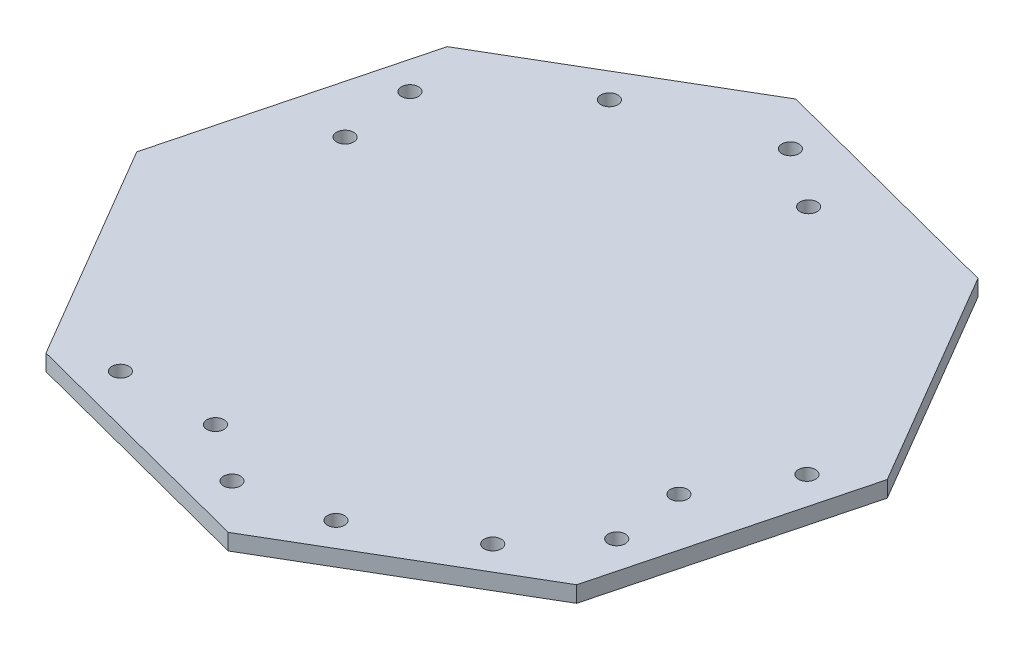
ISO-10303-21;
HEADER;
FILE_DESCRIPTION(('STEP AP214'),'2;1');
FILE_NAME('part.step','',(''),(''),'','','');
FILE_SCHEMA(('AUTOMOTIVE_DESIGN { 1 0 10303 214 1 1 1 1 }'));
ENDSEC;
DATA;
#1=APPLICATION_CONTEXT('core data for automotive mechanical design processes');
#2=APPLICATION_PROTOCOL_DEFINITION('international standard','automotive_design',2000,#1);
#3=PRODUCT_CONTEXT('',#1,'mechanical');
#4=PRODUCT('Part','Part','',(#3));
#5=PRODUCT_RELATED_PRODUCT_CATEGORY('part','',(#4));
#6=PRODUCT_DEFINITION_FORMATION('','',#4);
#7=PRODUCT_DEFINITION_CONTEXT('part definition',#1,'design');
#8=PRODUCT_DEFINITION('design','',#6,#7);
#9=PRODUCT_DEFINITION_SHAPE('','',#8);
#10=(LENGTH_UNIT() NAMED_UNIT(*) SI_UNIT(.MILLI.,.METRE.));
#11=(NAMED_UNIT(*) PLANE_ANGLE_UNIT() SI_UNIT($,.RADIAN.));
#12=(NAMED_UNIT(*) SI_UNIT($,.STERADIAN.) SOLID_ANGLE_UNIT());
#13=UNCERTAINTY_MEASURE_WITH_UNIT(LENGTH_MEASURE(1.E-05),#10,'distance_accuracy_value','');
#14=(GEOMETRIC_REPRESENTATION_CONTEXT(3) GLOBAL_UNCERTAINTY_ASSIGNED_CONTEXT((#13)) GLOBAL_UNIT_ASSIGNED_CONTEXT((#10,
#11,#12)) REPRESENTATION_CONTEXT('',''));
#15=CARTESIAN_POINT('',(0.,0.,0.));
#16=DIRECTION('',(0.,0.,1.));
#17=DIRECTION('',(1.,0.,0.));
#18=AXIS2_PLACEMENT_3D('',#15,#16,#17);
#19=CARTESIAN_POINT('',(-169.005629429316,-173.109741769084,-350.428110609482));
#20=DIRECTION('',(0.506112810529907,0.,0.862467288085477));
#21=DIRECTION('',(0.862467288085477,0.,-0.506112810529907));
#22=AXIS2_PLACEMENT_3D('',#19,#20,#21);
#23=PLANE('',#22);
#24=DIRECTION('',(0.862467288085477,0.,-0.506112810529907));
#25=VECTOR('',#24,1.);
#26=CARTESIAN_POINT('',(-169.005629429316,-170.109741769084,-350.428110609482));
#27=LINE('',#26,#25);
#28=CARTESIAN_POINT('',(-169.005629429316,-170.109741769084,-350.428110609482));
#29=VERTEX_POINT('',#28);
#30=CARTESIAN_POINT('',(-128.172451882559,-170.109741769084,-374.389824330743));
#31=VERTEX_POINT('',#30);
#32=EDGE_CURVE('E133',#29,#31,#27,.T.);
#33=ORIENTED_EDGE('',*,*,#32,.T.);
#34=DIRECTION('',(0.,1.,0.));
#35=VECTOR('',#34,1.);
#36=CARTESIAN_POINT('',(-128.172451882559,-173.109741769084,-374.389824330743));
#37=LINE('',#36,#35);
#38=CARTESIAN_POINT('',(-128.172451882559,-173.109741769084,-374.389824330743));
#39=VERTEX_POINT('',#38);
#40=EDGE_CURVE('E11',#39,#31,#37,.T.);
#41=ORIENTED_EDGE('',*,*,#40,.F.);
#42=DIRECTION('',(0.862467288085477,0.,-0.506112810529907));
#43=VECTOR('',#42,1.);
#44=CARTESIAN_POINT('',(-169.005629429316,-173.109741769084,-350.428110609482));
#45=LINE('',#44,#43);
#46=CARTESIAN_POINT('',(-169.005629429316,-173.109741769084,-350.428110609482));
#47=VERTEX_POINT('',#46);
#48=EDGE_CURVE('E148',#47,#39,#45,.T.);
#49=ORIENTED_EDGE('',*,*,#48,.F.);
#50=DIRECTION('',(0.,1.,0.));
#51=VECTOR('',#50,1.);
#52=CARTESIAN_POINT('',(-169.005629429316,-173.109741769084,-350.428110609482));
#53=LINE('',#52,#51);
#54=EDGE_CURVE('E129',#47,#29,#53,.T.);
#55=ORIENTED_EDGE('',*,*,#54,.T.);
#56=EDGE_LOOP('',(#33,#41,#49,#55));
#57=FACE_BOUND('',#56,.T.);
#58=ADVANCED_FACE('F37',(#57),#23,.F.);
#59=CARTESIAN_POINT('',(-128.172451882559,-173.109741769084,-374.389824330743));
#60=DIRECTION('',(-0.251980667585734,0.,0.967732268327892));
#61=DIRECTION('',(0.967732268327892,0.,0.251980667585734));
#62=AXIS2_PLACEMENT_3D('',#59,#60,#61);
#63=PLANE('',#62);
#64=DIRECTION('',(0.967732268327892,0.,0.251980667585734));
#65=VECTOR('',#64,1.);
#66=CARTESIAN_POINT('',(-128.172451882559,-170.109741769084,-374.389824330743));
#67=LINE('',#66,#65);
#68=CARTESIAN_POINT('',(-82.3555448806984,-170.109741769084,-362.45989785119));
#69=VERTEX_POINT('',#68);
#70=EDGE_CURVE('E136',#31,#69,#67,.T.);
#71=ORIENTED_EDGE('',*,*,#70,.T.);
#72=DIRECTION('',(0.,1.,0.));
#73=VECTOR('',#72,1.);
#74=CARTESIAN_POINT('',(-82.3555448806984,-173.109741769084,-362.45989785119));
#75=LINE('',#74,#73);
#76=CARTESIAN_POINT('',(-82.3555448806984,-173.109741769084,-362.45989785119));
#77=VERTEX_POINT('',#76);
#78=EDGE_CURVE('E45',#77,#69,#75,.T.);
#79=ORIENTED_EDGE('',*,*,#78,.F.);
#80=DIRECTION('',(0.967732268327892,0.,0.251980667585734));
#81=VECTOR('',#80,1.);
#82=CARTESIAN_POINT('',(-128.172451882559,-173.109741769084,-374.389824330743));
#83=LINE('',#82,#81);
#84=EDGE_CURVE('E96',#39,#77,#83,.T.);
#85=ORIENTED_EDGE('',*,*,#84,.F.);
#86=ORIENTED_EDGE('',*,*,#40,.T.);
#87=EDGE_LOOP('',(#71,#79,#85,#86));
#88=FACE_BOUND('',#87,.T.);
#89=ADVANCED_FACE('F307',(#88),#63,.F.);
#90=CARTESIAN_POINT('',(-82.3555448806984,-173.109741769084,-362.45989785119));
#91=DIRECTION('',(-0.862467288085477,0.,0.506112810529907));
#92=DIRECTION('',(0.506112810529907,0.,0.862467288085477));
#93=AXIS2_PLACEMENT_3D('',#90,#91,#92);
#94=PLANE('',#93);
#95=DIRECTION('',(0.506112810529907,0.,0.862467288085477));
#96=VECTOR('',#95,1.);
#97=CARTESIAN_POINT('',(-82.3555448806984,-170.109741769084,-362.45989785119));
#98=LINE('',#97,#96);
#99=CARTESIAN_POINT('',(-58.393831159438,-170.109741769084,-321.626720304433));
#100=VERTEX_POINT('',#99);
#101=EDGE_CURVE('E139',#69,#100,#98,.T.);
#102=ORIENTED_EDGE('',*,*,#101,.T.);
#103=DIRECTION('',(0.,1.,0.));
#104=VECTOR('',#103,1.);
#105=CARTESIAN_POINT('',(-58.393831159438,-173.109741769084,-321.626720304433));
#106=LINE('',#105,#104);
#107=CARTESIAN_POINT('',(-58.393831159438,-173.109741769084,-321.626720304433));
#108=VERTEX_POINT('',#107);
#109=EDGE_CURVE('E155',#108,#100,#106,.T.);
#110=ORIENTED_EDGE('',*,*,#109,.F.);
#111=DIRECTION('',(0.506112810529907,0.,0.862467288085477));
#112=VECTOR('',#111,1.);
#113=CARTESIAN_POINT('',(-82.3555448806984,-173.109741769084,-362.45989785119));
#114=LINE('',#113,#112);
#115=EDGE_CURVE('E163',#77,#108,#114,.T.);
#116=ORIENTED_EDGE('',*,*,#115,.F.);
#117=ORIENTED_EDGE('',*,*,#78,.T.);
#118=EDGE_LOOP('',(#102,#110,#116,#117));
#119=FACE_BOUND('',#118,.T.);
#120=ADVANCED_FACE('F161',(#119),#94,.F.);
#121=CARTESIAN_POINT('',(-58.393831159438,-173.109741769084,-321.626720304433));
#122=DIRECTION('',(-0.967732268327892,0.,-0.251980667585733));
#123=DIRECTION('',(-0.251980667585733,0.,0.967732268327892));
#124=AXIS2_PLACEMENT_3D('',#121,#122,#123);
#125=PLANE('',#124);
#126=DIRECTION('',(-0.251980667585733,0.,0.967732268327893));
#127=VECTOR('',#126,1.);
#128=CARTESIAN_POINT('',(-58.393831159438,-170.109741769084,-321.626720304433));
#129=LINE('',#128,#127);
#130=CARTESIAN_POINT('',(-70.3237576389904,-170.109741769084,-275.809813302572));
#131=VERTEX_POINT('',#130);
#132=EDGE_CURVE('E141',#100,#131,#129,.T.);
#133=ORIENTED_EDGE('',*,*,#132,.T.);
#134=DIRECTION('',(0.,1.,0.));
#135=VECTOR('',#134,1.);
#136=CARTESIAN_POINT('',(-70.3237576389904,-173.109741769084,-275.809813302572));
#137=LINE('',#136,#135);
#138=CARTESIAN_POINT('',(-70.3237576389904,-173.109741769084,-275.809813302572));
#139=VERTEX_POINT('',#138);
#140=EDGE_CURVE('E152',#139,#131,#137,.T.);
#141=ORIENTED_EDGE('',*,*,#140,.F.);
#142=DIRECTION('',(-0.251980667585733,0.,0.967732268327893));
#143=VECTOR('',#142,1.);
#144=CARTESIAN_POINT('',(-58.393831159438,-173.109741769084,-321.626720304433));
#145=LINE('',#144,#143);
#146=EDGE_CURVE('E175',#108,#139,#145,.T.);
#147=ORIENTED_EDGE('',*,*,#146,.F.);
#148=ORIENTED_EDGE('',*,*,#109,.T.);
#149=EDGE_LOOP('',(#133,#141,#147,#148));
#150=FACE_BOUND('',#149,.T.);
#151=ADVANCED_FACE('F171',(#150),#125,.F.);
#152=CARTESIAN_POINT('',(-70.3237576389904,-173.109741769084,-275.809813302572));
#153=DIRECTION('',(-0.506112810529908,0.,-0.862467288085477));
#154=DIRECTION('',(-0.862467288085477,0.,0.506112810529908));
#155=AXIS2_PLACEMENT_3D('',#152,#153,#154);
#156=PLANE('',#155);
#157=DIRECTION('',(-0.862467288085477,0.,0.506112810529908));
#158=VECTOR('',#157,1.);
#159=CARTESIAN_POINT('',(-70.3237576389904,-170.109741769084,-275.809813302572));
#160=LINE('',#159,#158);
#161=CARTESIAN_POINT('',(-111.156935185748,-170.109741769084,-251.848099581312));
#162=VERTEX_POINT('',#161);
#163=EDGE_CURVE('E143',#131,#162,#160,.T.);
#164=ORIENTED_EDGE('',*,*,#163,.T.);
#165=DIRECTION('',(0.,1.,0.));
#166=VECTOR('',#165,1.);
#167=CARTESIAN_POINT('',(-111.156935185748,-173.109741769084,-251.848099581312));
#168=LINE('',#167,#166);
#169=CARTESIAN_POINT('',(-111.156935185748,-173.109741769084,-251.848099581312));
#170=VERTEX_POINT('',#169);
#171=EDGE_CURVE('E124',#170,#162,#168,.T.);
#172=ORIENTED_EDGE('',*,*,#171,.F.);
#173=DIRECTION('',(-0.862467288085477,0.,0.506112810529908));
#174=VECTOR('',#173,1.);
#175=CARTESIAN_POINT('',(-70.3237576389904,-173.109741769084,-275.809813302572));
#176=LINE('',#175,#174);
#177=EDGE_CURVE('E115',#139,#170,#176,.T.);
#178=ORIENTED_EDGE('',*,*,#177,.F.);
#179=ORIENTED_EDGE('',*,*,#140,.T.);
#180=EDGE_LOOP('',(#164,#172,#178,#179));
#181=FACE_BOUND('',#180,.T.);
#182=ADVANCED_FACE('F174',(#181),#156,.F.);
#183=CARTESIAN_POINT('',(-111.156935185748,-173.109741769084,-251.848099581312));
#184=DIRECTION('',(0.251980667585733,0.,-0.967732268327893));
#185=DIRECTION('',(-0.967732268327893,0.,-0.251980667585733));
#186=AXIS2_PLACEMENT_3D('',#183,#184,#185);
#187=PLANE('',#186);
#188=DIRECTION('',(-0.967732268327893,0.,-0.251980667585733));
#189=VECTOR('',#188,1.);
#190=CARTESIAN_POINT('',(-111.156935185748,-170.109741769084,-251.848099581312));
#191=LINE('',#190,#189);
#192=CARTESIAN_POINT('',(-156.973842187608,-170.109741769084,-263.778026060864));
#193=VERTEX_POINT('',#192);
#194=EDGE_CURVE('E123',#162,#193,#191,.T.);
#195=ORIENTED_EDGE('',*,*,#194,.T.);
#196=DIRECTION('',(0.,1.,0.));
#197=VECTOR('',#196,1.);
#198=CARTESIAN_POINT('',(-156.973842187608,-173.109741769084,-263.778026060864));
#199=LINE('',#198,#197);
#200=CARTESIAN_POINT('',(-156.973842187608,-173.109741769084,-263.778026060864));
#201=VERTEX_POINT('',#200);
#202=EDGE_CURVE('E120',#201,#193,#199,.T.);
#203=ORIENTED_EDGE('',*,*,#202,.F.);
#204=DIRECTION('',(-0.967732268327893,0.,-0.251980667585733));
#205=VECTOR('',#204,1.);
#206=CARTESIAN_POINT('',(-111.156935185748,-173.109741769084,-251.848099581312));
#207=LINE('',#206,#205);
#208=EDGE_CURVE('E109',#170,#201,#207,.T.);
#209=ORIENTED_EDGE('',*,*,#208,.F.);
#210=ORIENTED_EDGE('',*,*,#171,.T.);
#211=EDGE_LOOP('',(#195,#203,#209,#210));
#212=FACE_BOUND('',#211,.T.);
#213=ADVANCED_FACE('F121',(#212),#187,.F.);
#214=CARTESIAN_POINT('',(-156.973842187608,-173.109741769084,-263.778026060864));
#215=DIRECTION('',(0.862467288085478,0.,-0.506112810529907));
#216=DIRECTION('',(-0.506112810529907,0.,-0.862467288085478));
#217=AXIS2_PLACEMENT_3D('',#214,#215,#216);
#218=PLANE('',#217);
#219=DIRECTION('',(-0.506112810529907,0.,-0.862467288085478));
#220=VECTOR('',#219,1.);
#221=CARTESIAN_POINT('',(-156.973842187608,-170.109741769084,-263.778026060864));
#222=LINE('',#221,#220);
#223=CARTESIAN_POINT('',(-180.935555908868,-170.109741769084,-304.611203607622));
#224=VERTEX_POINT('',#223);
#225=EDGE_CURVE('E82',#193,#224,#222,.T.);
#226=ORIENTED_EDGE('',*,*,#225,.T.);
#227=DIRECTION('',(0.,1.,0.));
#228=VECTOR('',#227,1.);
#229=CARTESIAN_POINT('',(-180.935555908868,-173.109741769084,-304.611203607622));
#230=LINE('',#229,#228);
#231=CARTESIAN_POINT('',(-180.935555908868,-173.109741769084,-304.611203607622));
#232=VERTEX_POINT('',#231);
#233=EDGE_CURVE('E125',#232,#224,#230,.T.);
#234=ORIENTED_EDGE('',*,*,#233,.F.);
#235=DIRECTION('',(-0.506112810529907,0.,-0.862467288085478));
#236=VECTOR('',#235,1.);
#237=CARTESIAN_POINT('',(-156.973842187608,-173.109741769084,-263.778026060864));
#238=LINE('',#237,#236);
#239=EDGE_CURVE('E113',#201,#232,#238,.T.);
#240=ORIENTED_EDGE('',*,*,#239,.F.);
#241=ORIENTED_EDGE('',*,*,#202,.T.);
#242=EDGE_LOOP('',(#226,#234,#240,#241));
#243=FACE_BOUND('',#242,.T.);
#244=ADVANCED_FACE('F127',(#243),#218,.F.);
#245=CARTESIAN_POINT('',(-180.935555908868,-173.109741769084,-304.611203607622));
#246=DIRECTION('',(0.967732268327893,0.,0.251980667585733));
#247=DIRECTION('',(0.251980667585733,0.,-0.967732268327893));
#248=AXIS2_PLACEMENT_3D('',#245,#246,#247);
#249=PLANE('',#248);
#250=DIRECTION('',(0.251980667585733,0.,-0.967732268327893));
#251=VECTOR('',#250,1.);
#252=CARTESIAN_POINT('',(-180.935555908868,-170.109741769084,-304.611203607622));
#253=LINE('',#252,#251);
#254=EDGE_CURVE('E88',#224,#29,#253,.T.);
#255=ORIENTED_EDGE('',*,*,#254,.T.);
#256=ORIENTED_EDGE('',*,*,#54,.F.);
#257=DIRECTION('',(0.251980667585733,0.,-0.967732268327893));
#258=VECTOR('',#257,1.);
#259=CARTESIAN_POINT('',(-180.935555908868,-173.109741769084,-304.611203607622));
#260=LINE('',#259,#258);
#261=EDGE_CURVE('E53',#232,#47,#260,.T.);
#262=ORIENTED_EDGE('',*,*,#261,.F.);
#263=ORIENTED_EDGE('',*,*,#233,.T.);
#264=EDGE_LOOP('',(#255,#256,#262,#263));
#265=FACE_BOUND('',#264,.T.);
#266=ADVANCED_FACE('F297',(#265),#249,.F.);
#267=CARTESIAN_POINT('',(0.,-173.109741769084,0.));
#268=DIRECTION('',(0.,-1.,0.));
#269=DIRECTION('',(0.,0.,-1.));
#270=AXIS2_PLACEMENT_3D('',#267,#268,#269);
#271=PLANE('',#270);
#272=CARTESIAN_POINT('',(-163.939086587939,-173.109741769084,-326.354614997378));
#273=DIRECTION('',(0.,-1.,0.));
#274=DIRECTION('',(0.,0.,-1.));
#275=AXIS2_PLACEMENT_3D('',#272,#273,#274);
#276=CIRCLE('',#275,1.58750000000004);
#277=CARTESIAN_POINT('',(-163.939086587939,-173.109741769084,-327.942114997378));
#278=VERTEX_POINT('',#277);
#279=EDGE_CURVE('E194',#278,#278,#276,.F.);
#280=ORIENTED_EDGE('',*,*,#279,.T.);
#281=EDGE_LOOP('',(#280));
#282=FACE_BOUND('',#281,.T.);
#283=CARTESIAN_POINT('',(-109.626964847531,-173.109741769084,-358.226038945408));
#284=DIRECTION('',(0.,-1.,0.));
#285=DIRECTION('',(0.,0.,-1.));
#286=AXIS2_PLACEMENT_3D('',#283,#284,#285);
#287=CIRCLE('',#286,1.58750000000004);
#288=CARTESIAN_POINT('',(-109.626964847531,-173.109741769084,-359.813538945408));
#289=VERTEX_POINT('',#288);
#290=EDGE_CURVE('E245',#289,#289,#287,.F.);
#291=ORIENTED_EDGE('',*,*,#290,.T.);
#292=EDGE_LOOP('',(#291));
#293=FACE_BOUND('',#292,.T.);
#294=CARTESIAN_POINT('',(-75.3903004803161,-173.109741769084,-299.88330891459));
#295=DIRECTION('',(0.,-1.,0.));
#296=DIRECTION('',(0.,0.,-1.));
#297=AXIS2_PLACEMENT_3D('',#294,#295,#296);
#298=CIRCLE('',#297,1.58750000000004);
#299=CARTESIAN_POINT('',(-75.3903004803161,-173.109741769084,-301.47080891459));
#300=VERTEX_POINT('',#299);
#301=EDGE_CURVE('E238',#300,#300,#298,.F.);
#302=ORIENTED_EDGE('',*,*,#301,.T.);
#303=EDGE_LOOP('',(#302));
#304=FACE_BOUND('',#303,.T.);
#305=CARTESIAN_POINT('',(-129.702422220724,-173.109741769084,-268.01188496656));
#306=DIRECTION('',(0.,-1.,0.));
#307=DIRECTION('',(0.,0.,-1.));
#308=AXIS2_PLACEMENT_3D('',#305,#306,#307);
#309=CIRCLE('',#308,1.58750000000004);
#310=CARTESIAN_POINT('',(-129.702422220724,-173.109741769084,-269.59938496656));
#311=VERTEX_POINT('',#310);
#312=EDGE_CURVE('E239',#311,#311,#309,.F.);
#313=ORIENTED_EDGE('',*,*,#312,.T.);
#314=EDGE_LOOP('',(#313));
#315=FACE_BOUND('',#314,.T.);
#316=CARTESIAN_POINT('',(-66.6857055285659,-173.109741769084,-314.98210582665));
#317=DIRECTION('',(0.,-1.,0.));
#318=DIRECTION('',(0.,0.,-1.));
#319=AXIS2_PLACEMENT_3D('',#316,#317,#318);
#320=CIRCLE('',#319,1.58750000000006);
#321=CARTESIAN_POINT('',(-66.6857055285659,-173.109741769084,-316.56960582665));
#322=VERTEX_POINT('',#321);
#323=EDGE_CURVE('E187',#322,#322,#320,.T.);
#324=ORIENTED_EDGE('',*,*,#323,.F.);
#325=EDGE_LOOP('',(#324));
#326=FACE_BOUND('',#325,.T.);
#327=CARTESIAN_POINT('',(-73.9922565195987,-173.109741769084,-286.92128182792));
#328=DIRECTION('',(0.,-1.,0.));
#329=DIRECTION('',(0.,0.,-1.));
#330=AXIS2_PLACEMENT_3D('',#327,#328,#329);
#331=CIRCLE('',#330,1.58750000000001);
#332=CARTESIAN_POINT('',(-73.9922565195987,-173.109741769084,-288.50878182792));
#333=VERTEX_POINT('',#332);
#334=EDGE_CURVE('E195',#333,#333,#331,.T.);
#335=ORIENTED_EDGE('',*,*,#334,.F.);
#336=EDGE_LOOP('',(#335));
#337=FACE_BOUND('',#336,.T.);
#338=CARTESIAN_POINT('',(-84.6935798319424,-173.109741769084,-274.567395605343));
#339=DIRECTION('',(0.,-1.,0.));
#340=DIRECTION('',(0.,0.,-1.));
#341=AXIS2_PLACEMENT_3D('',#338,#339,#340);
#342=CIRCLE('',#341,1.5875);
#343=CARTESIAN_POINT('',(-84.6935798319424,-173.109741769084,-276.154895605343));
#344=VERTEX_POINT('',#343);
#345=EDGE_CURVE('E201',#344,#344,#342,.T.);
#346=ORIENTED_EDGE('',*,*,#345,.F.);
#347=EDGE_LOOP('',(#346));
#348=FACE_BOUND('',#347,.T.);
#349=CARTESIAN_POINT('',(-103.064133068163,-173.109741769084,-263.787192741056));
#350=DIRECTION('',(0.,-1.,0.));
#351=DIRECTION('',(0.,0.,-1.));
#352=AXIS2_PLACEMENT_3D('',#349,#350,#351);
#353=CIRCLE('',#352,1.58749999999973);
#354=CARTESIAN_POINT('',(-103.064133068163,-173.109741769084,-265.374692741056));
#355=VERTEX_POINT('',#354);
#356=EDGE_CURVE('E207',#355,#355,#353,.T.);
#357=ORIENTED_EDGE('',*,*,#356,.F.);
#358=EDGE_LOOP('',(#357));
#359=FACE_BOUND('',#358,.T.);
#360=CARTESIAN_POINT('',(-119.068249232774,-173.109741769084,-260.469800508399));
#361=DIRECTION('',(0.,-1.,0.));
#362=DIRECTION('',(0.,0.,-1.));
#363=AXIS2_PLACEMENT_3D('',#360,#361,#362);
#364=CIRCLE('',#363,1.58749999999981);
#365=CARTESIAN_POINT('',(-119.068249232774,-173.109741769084,-262.057300508399));
#366=VERTEX_POINT('',#365);
#367=EDGE_CURVE('E213',#366,#366,#364,.T.);
#368=ORIENTED_EDGE('',*,*,#367,.F.);
#369=EDGE_LOOP('',(#368));
#370=FACE_BOUND('',#369,.T.);
#371=CARTESIAN_POINT('',(-147.129073231504,-173.109741769084,-267.776351499432));
#372=DIRECTION('',(0.,-1.,0.));
#373=DIRECTION('',(0.,0.,-1.));
#374=AXIS2_PLACEMENT_3D('',#371,#372,#373);
#375=CIRCLE('',#374,1.58749999999978);
#376=CARTESIAN_POINT('',(-147.129073231504,-173.109741769084,-269.363851499432));
#377=VERTEX_POINT('',#376);
#378=EDGE_CURVE('E219',#377,#377,#375,.T.);
#379=ORIENTED_EDGE('',*,*,#378,.F.);
#380=EDGE_LOOP('',(#379));
#381=FACE_BOUND('',#380,.T.);
#382=CARTESIAN_POINT('',(-165.234257313156,-173.109741769084,-339.71172695502));
#383=DIRECTION('',(0.,-1.,0.));
#384=DIRECTION('',(0.,0.,-1.));
#385=AXIS2_PLACEMENT_3D('',#382,#383,#384);
#386=CIRCLE('',#385,1.58750000000001);
#387=CARTESIAN_POINT('',(-165.234257313156,-173.109741769084,-341.299226955021));
#388=VERTEX_POINT('',#387);
#389=EDGE_CURVE('E225',#388,#388,#386,.T.);
#390=ORIENTED_EDGE('',*,*,#389,.F.);
#391=EDGE_LOOP('',(#390));
#392=FACE_BOUND('',#391,.T.);
#393=CARTESIAN_POINT('',(-120.656222706454,-173.109741769084,-365.870996639069));
#394=DIRECTION('',(0.,-1.,0.));
#395=DIRECTION('',(0.,0.,-1.));
#396=AXIS2_PLACEMENT_3D('',#393,#394,#395);
#397=CIRCLE('',#396,1.58749999999995);
#398=CARTESIAN_POINT('',(-120.656222706454,-173.109741769084,-367.458496639069));
#399=VERTEX_POINT('',#398);
#400=EDGE_CURVE('E186',#399,#399,#397,.T.);
#401=ORIENTED_EDGE('',*,*,#400,.F.);
#402=EDGE_LOOP('',(#401));
#403=FACE_BOUND('',#402,.T.);
#404=CARTESIAN_POINT('',(-145.375224309047,-173.109741769084,-356.932300190726));
#405=DIRECTION('',(0.,-1.,0.));
#406=DIRECTION('',(0.,0.,-1.));
#407=AXIS2_PLACEMENT_3D('',#404,#405,#406);
#408=CIRCLE('',#407,1.58750000000011);
#409=CARTESIAN_POINT('',(-145.375224309047,-173.109741769084,-358.519800190726));
#410=VERTEX_POINT('',#409);
#411=EDGE_CURVE('E183',#410,#410,#408,.T.);
#412=ORIENTED_EDGE('',*,*,#411,.F.);
#413=EDGE_LOOP('',(#412));
#414=FACE_BOUND('',#413,.T.);
#415=ORIENTED_EDGE('',*,*,#48,.T.);
#416=ORIENTED_EDGE('',*,*,#84,.T.);
#417=ORIENTED_EDGE('',*,*,#115,.T.);
#418=ORIENTED_EDGE('',*,*,#146,.T.);
#419=ORIENTED_EDGE('',*,*,#177,.T.);
#420=ORIENTED_EDGE('',*,*,#208,.T.);
#421=ORIENTED_EDGE('',*,*,#239,.T.);
#422=ORIENTED_EDGE('',*,*,#261,.T.);
#423=EDGE_LOOP('',(#415,#416,#417,#418,#419,#420,#421,#422));
#424=FACE_BOUND('',#423,.T.);
#425=ADVANCED_FACE('F111',(#282,#293,#304,#315,#326,#337,#348,#359,#370,#381,#392,#403,#414,
#424),#271,.T.);
#426=CARTESIAN_POINT('',(0.,-170.109741769084,0.));
#427=DIRECTION('',(0.,-1.,0.));
#428=DIRECTION('',(0.,0.,-1.));
#429=AXIS2_PLACEMENT_3D('',#426,#427,#428);
#430=PLANE('',#429);
#431=CARTESIAN_POINT('',(-163.939086587939,-170.109741769084,-326.354614997378));
#432=DIRECTION('',(0.,1.,0.));
#433=DIRECTION('',(0.,0.,1.));
#434=AXIS2_PLACEMENT_3D('',#431,#432,#433);
#435=CIRCLE('',#434,1.58750000000004);
#436=CARTESIAN_POINT('',(-163.939086587939,-170.109741769084,-324.767114997378));
#437=VERTEX_POINT('',#436);
#438=EDGE_CURVE('E251',#437,#437,#435,.T.);
#439=ORIENTED_EDGE('',*,*,#438,.F.);
#440=EDGE_LOOP('',(#439));
#441=FACE_BOUND('',#440,.T.);
#442=CARTESIAN_POINT('',(-109.626964847531,-170.109741769084,-358.226038945408));
#443=DIRECTION('',(0.,1.,0.));
#444=DIRECTION('',(0.,0.,1.));
#445=AXIS2_PLACEMENT_3D('',#442,#443,#444);
#446=CIRCLE('',#445,1.58750000000004);
#447=CARTESIAN_POINT('',(-109.626964847531,-170.109741769084,-356.638538945408));
#448=VERTEX_POINT('',#447);
#449=EDGE_CURVE('E248',#448,#448,#446,.T.);
#450=ORIENTED_EDGE('',*,*,#449,.F.);
#451=EDGE_LOOP('',(#450));
#452=FACE_BOUND('',#451,.T.);
#453=CARTESIAN_POINT('',(-75.3903004803161,-170.109741769084,-299.88330891459));
#454=DIRECTION('',(0.,1.,0.));
#455=DIRECTION('',(0.,0.,1.));
#456=AXIS2_PLACEMENT_3D('',#453,#454,#455);
#457=CIRCLE('',#456,1.58750000000004);
#458=CARTESIAN_POINT('',(-75.3903004803161,-170.109741769084,-298.29580891459));
#459=VERTEX_POINT('',#458);
#460=EDGE_CURVE('E242',#459,#459,#457,.T.);
#461=ORIENTED_EDGE('',*,*,#460,.F.);
#462=EDGE_LOOP('',(#461));
#463=FACE_BOUND('',#462,.T.);
#464=CARTESIAN_POINT('',(-129.702422220724,-170.109741769084,-268.01188496656));
#465=DIRECTION('',(0.,1.,0.));
#466=DIRECTION('',(0.,0.,1.));
#467=AXIS2_PLACEMENT_3D('',#464,#465,#466);
#468=CIRCLE('',#467,1.58750000000004);
#469=CARTESIAN_POINT('',(-129.702422220724,-170.109741769084,-266.42438496656));
#470=VERTEX_POINT('',#469);
#471=EDGE_CURVE('E235',#470,#470,#468,.T.);
#472=ORIENTED_EDGE('',*,*,#471,.F.);
#473=EDGE_LOOP('',(#472));
#474=FACE_BOUND('',#473,.T.);
#475=CARTESIAN_POINT('',(-66.6857055285659,-170.109741769084,-314.98210582665));
#476=DIRECTION('',(0.,-1.,0.));
#477=DIRECTION('',(0.,0.,-1.));
#478=AXIS2_PLACEMENT_3D('',#475,#476,#477);
#479=CIRCLE('',#478,1.58750000000006);
#480=CARTESIAN_POINT('',(-66.6857055285659,-170.109741769084,-316.56960582665));
#481=VERTEX_POINT('',#480);
#482=EDGE_CURVE('E191',#481,#481,#479,.F.);
#483=ORIENTED_EDGE('',*,*,#482,.F.);
#484=EDGE_LOOP('',(#483));
#485=FACE_BOUND('',#484,.T.);
#486=CARTESIAN_POINT('',(-73.9922565195987,-170.109741769084,-286.92128182792));
#487=DIRECTION('',(0.,-1.,0.));
#488=DIRECTION('',(0.,0.,-1.));
#489=AXIS2_PLACEMENT_3D('',#486,#487,#488);
#490=CIRCLE('',#489,1.58750000000001);
#491=CARTESIAN_POINT('',(-73.9922565195987,-170.109741769084,-288.50878182792));
#492=VERTEX_POINT('',#491);
#493=EDGE_CURVE('E190',#492,#492,#490,.F.);
#494=ORIENTED_EDGE('',*,*,#493,.F.);
#495=EDGE_LOOP('',(#494));
#496=FACE_BOUND('',#495,.T.);
#497=CARTESIAN_POINT('',(-84.6935798319424,-170.109741769084,-274.567395605343));
#498=DIRECTION('',(0.,-1.,0.));
#499=DIRECTION('',(0.,0.,-1.));
#500=AXIS2_PLACEMENT_3D('',#497,#498,#499);
#501=CIRCLE('',#500,1.5875);
#502=CARTESIAN_POINT('',(-84.6935798319424,-170.109741769084,-276.154895605343));
#503=VERTEX_POINT('',#502);
#504=EDGE_CURVE('E198',#503,#503,#501,.F.);
#505=ORIENTED_EDGE('',*,*,#504,.F.);
#506=EDGE_LOOP('',(#505));
#507=FACE_BOUND('',#506,.T.);
#508=CARTESIAN_POINT('',(-103.064133068163,-170.109741769084,-263.787192741056));
#509=DIRECTION('',(0.,-1.,0.));
#510=DIRECTION('',(0.,0.,-1.));
#511=AXIS2_PLACEMENT_3D('',#508,#509,#510);
#512=CIRCLE('',#511,1.58749999999973);
#513=CARTESIAN_POINT('',(-103.064133068163,-170.109741769084,-265.374692741056));
#514=VERTEX_POINT('',#513);
#515=EDGE_CURVE('E204',#514,#514,#512,.F.);
#516=ORIENTED_EDGE('',*,*,#515,.F.);
#517=EDGE_LOOP('',(#516));
#518=FACE_BOUND('',#517,.T.);
#519=CARTESIAN_POINT('',(-119.068249232774,-170.109741769084,-260.469800508399));
#520=DIRECTION('',(0.,-1.,0.));
#521=DIRECTION('',(0.,0.,-1.));
#522=AXIS2_PLACEMENT_3D('',#519,#520,#521);
#523=CIRCLE('',#522,1.58749999999981);
#524=CARTESIAN_POINT('',(-119.068249232774,-170.109741769084,-262.057300508399));
#525=VERTEX_POINT('',#524);
#526=EDGE_CURVE('E210',#525,#525,#523,.F.);
#527=ORIENTED_EDGE('',*,*,#526,.F.);
#528=EDGE_LOOP('',(#527));
#529=FACE_BOUND('',#528,.T.);
#530=CARTESIAN_POINT('',(-147.129073231504,-170.109741769084,-267.776351499432));
#531=DIRECTION('',(0.,-1.,0.));
#532=DIRECTION('',(0.,0.,-1.));
#533=AXIS2_PLACEMENT_3D('',#530,#531,#532);
#534=CIRCLE('',#533,1.58749999999978);
#535=CARTESIAN_POINT('',(-147.129073231504,-170.109741769084,-269.363851499432));
#536=VERTEX_POINT('',#535);
#537=EDGE_CURVE('E216',#536,#536,#534,.F.);
#538=ORIENTED_EDGE('',*,*,#537,.F.);
#539=EDGE_LOOP('',(#538));
#540=FACE_BOUND('',#539,.T.);
#541=CARTESIAN_POINT('',(-165.234257313156,-170.109741769084,-339.71172695502));
#542=DIRECTION('',(0.,-1.,0.));
#543=DIRECTION('',(0.,0.,-1.));
#544=AXIS2_PLACEMENT_3D('',#541,#542,#543);
#545=CIRCLE('',#544,1.58750000000001);
#546=CARTESIAN_POINT('',(-165.234257313156,-170.109741769084,-341.299226955021));
#547=VERTEX_POINT('',#546);
#548=EDGE_CURVE('E222',#547,#547,#545,.F.);
#549=ORIENTED_EDGE('',*,*,#548,.F.);
#550=EDGE_LOOP('',(#549));
#551=FACE_BOUND('',#550,.T.);
#552=CARTESIAN_POINT('',(-120.656222706454,-170.109741769084,-365.870996639069));
#553=DIRECTION('',(0.,-1.,0.));
#554=DIRECTION('',(0.,0.,-1.));
#555=AXIS2_PLACEMENT_3D('',#552,#553,#554);
#556=CIRCLE('',#555,1.58749999999995);
#557=CARTESIAN_POINT('',(-120.656222706454,-170.109741769084,-367.458496639069));
#558=VERTEX_POINT('',#557);
#559=EDGE_CURVE('E228',#558,#558,#556,.F.);
#560=ORIENTED_EDGE('',*,*,#559,.F.);
#561=EDGE_LOOP('',(#560));
#562=FACE_BOUND('',#561,.T.);
#563=CARTESIAN_POINT('',(-145.375224309047,-170.109741769084,-356.932300190726));
#564=DIRECTION('',(0.,-1.,0.));
#565=DIRECTION('',(0.,0.,-1.));
#566=AXIS2_PLACEMENT_3D('',#563,#564,#565);
#567=CIRCLE('',#566,1.58750000000011);
#568=CARTESIAN_POINT('',(-145.375224309047,-170.109741769084,-358.519800190726));
#569=VERTEX_POINT('',#568);
#570=EDGE_CURVE('E137',#569,#569,#567,.F.);
#571=ORIENTED_EDGE('',*,*,#570,.F.);
#572=EDGE_LOOP('',(#571));
#573=FACE_BOUND('',#572,.T.);
#574=ORIENTED_EDGE('',*,*,#32,.F.);
#575=ORIENTED_EDGE('',*,*,#254,.F.);
#576=ORIENTED_EDGE('',*,*,#225,.F.);
#577=ORIENTED_EDGE('',*,*,#194,.F.);
#578=ORIENTED_EDGE('',*,*,#163,.F.);
#579=ORIENTED_EDGE('',*,*,#132,.F.);
#580=ORIENTED_EDGE('',*,*,#101,.F.);
#581=ORIENTED_EDGE('',*,*,#70,.F.);
#582=EDGE_LOOP('',(#574,#575,#576,#577,#578,#579,#580,#581));
#583=FACE_BOUND('',#582,.T.);
#584=ADVANCED_FACE('F167',(#441,#452,#463,#474,#485,#496,#507,#518,#529,#540,#551,#562,#573,
#583),#430,.F.);
#585=CARTESIAN_POINT('',(-145.375224309047,-165.619613708549,-356.932300190726));
#586=DIRECTION('',(0.,-1.,0.));
#587=DIRECTION('',(0.,0.,-1.));
#588=AXIS2_PLACEMENT_3D('',#585,#586,#587);
#589=CYLINDRICAL_SURFACE('',#588,1.58750000000011);
#590=ORIENTED_EDGE('',*,*,#570,.T.);
#591=EDGE_LOOP('',(#590));
#592=FACE_BOUND('',#591,.T.);
#593=ORIENTED_EDGE('',*,*,#411,.T.);
#594=EDGE_LOOP('',(#593));
#595=FACE_BOUND('',#594,.T.);
#596=ADVANCED_FACE('F264',(#592,#595),#589,.F.);
#597=CARTESIAN_POINT('',(-120.656222706454,-165.619613708549,-365.870996639069));
#598=DIRECTION('',(0.,-1.,0.));
#599=DIRECTION('',(0.,0.,-1.));
#600=AXIS2_PLACEMENT_3D('',#597,#598,#599);
#601=CYLINDRICAL_SURFACE('',#600,1.58749999999995);
#602=ORIENTED_EDGE('',*,*,#559,.T.);
#603=EDGE_LOOP('',(#602));
#604=FACE_BOUND('',#603,.T.);
#605=ORIENTED_EDGE('',*,*,#400,.T.);
#606=EDGE_LOOP('',(#605));
#607=FACE_BOUND('',#606,.T.);
#608=ADVANCED_FACE('F292',(#604,#607),#601,.F.);
#609=CARTESIAN_POINT('',(-165.234257313156,-165.619613708549,-339.71172695502));
#610=DIRECTION('',(0.,-1.,0.));
#611=DIRECTION('',(0.,0.,-1.));
#612=AXIS2_PLACEMENT_3D('',#609,#610,#611);
#613=CYLINDRICAL_SURFACE('',#612,1.58750000000001);
#614=ORIENTED_EDGE('',*,*,#548,.T.);
#615=EDGE_LOOP('',(#614));
#616=FACE_BOUND('',#615,.T.);
#617=ORIENTED_EDGE('',*,*,#389,.T.);
#618=EDGE_LOOP('',(#617));
#619=FACE_BOUND('',#618,.T.);
#620=ADVANCED_FACE('F357',(#616,#619),#613,.F.);
#621=CARTESIAN_POINT('',(-147.129073231504,-165.619613708549,-267.776351499432));
#622=DIRECTION('',(0.,-1.,0.));
#623=DIRECTION('',(0.,0.,-1.));
#624=AXIS2_PLACEMENT_3D('',#621,#622,#623);
#625=CYLINDRICAL_SURFACE('',#624,1.58749999999978);
#626=ORIENTED_EDGE('',*,*,#537,.T.);
#627=EDGE_LOOP('',(#626));
#628=FACE_BOUND('',#627,.T.);
#629=ORIENTED_EDGE('',*,*,#378,.T.);
#630=EDGE_LOOP('',(#629));
#631=FACE_BOUND('',#630,.T.);
#632=ADVANCED_FACE('F365',(#628,#631),#625,.F.);
#633=CARTESIAN_POINT('',(-119.068249232774,-165.619613708549,-260.469800508399));
#634=DIRECTION('',(0.,-1.,0.));
#635=DIRECTION('',(0.,0.,-1.));
#636=AXIS2_PLACEMENT_3D('',#633,#634,#635);
#637=CYLINDRICAL_SURFACE('',#636,1.58749999999981);
#638=ORIENTED_EDGE('',*,*,#526,.T.);
#639=EDGE_LOOP('',(#638));
#640=FACE_BOUND('',#639,.T.);
#641=ORIENTED_EDGE('',*,*,#367,.T.);
#642=EDGE_LOOP('',(#641));
#643=FACE_BOUND('',#642,.T.);
#644=ADVANCED_FACE('F373',(#640,#643),#637,.F.);
#645=CARTESIAN_POINT('',(-103.064133068163,-165.619613708549,-263.787192741056));
#646=DIRECTION('',(0.,-1.,0.));
#647=DIRECTION('',(0.,0.,-1.));
#648=AXIS2_PLACEMENT_3D('',#645,#646,#647);
#649=CYLINDRICAL_SURFACE('',#648,1.58749999999973);
#650=ORIENTED_EDGE('',*,*,#515,.T.);
#651=EDGE_LOOP('',(#650));
#652=FACE_BOUND('',#651,.T.);
#653=ORIENTED_EDGE('',*,*,#356,.T.);
#654=EDGE_LOOP('',(#653));
#655=FACE_BOUND('',#654,.T.);
#656=ADVANCED_FACE('F381',(#652,#655),#649,.F.);
#657=CARTESIAN_POINT('',(-84.6935798319424,-165.619613708549,-274.567395605343));
#658=DIRECTION('',(0.,-1.,0.));
#659=DIRECTION('',(0.,0.,-1.));
#660=AXIS2_PLACEMENT_3D('',#657,#658,#659);
#661=CYLINDRICAL_SURFACE('',#660,1.5875);
#662=ORIENTED_EDGE('',*,*,#504,.T.);
#663=EDGE_LOOP('',(#662));
#664=FACE_BOUND('',#663,.T.);
#665=ORIENTED_EDGE('',*,*,#345,.T.);
#666=EDGE_LOOP('',(#665));
#667=FACE_BOUND('',#666,.T.);
#668=ADVANCED_FACE('F389',(#664,#667),#661,.F.);
#669=CARTESIAN_POINT('',(-73.9922565195987,-165.619613708549,-286.92128182792));
#670=DIRECTION('',(0.,-1.,0.));
#671=DIRECTION('',(0.,0.,-1.));
#672=AXIS2_PLACEMENT_3D('',#669,#670,#671);
#673=CYLINDRICAL_SURFACE('',#672,1.58750000000001);
#674=ORIENTED_EDGE('',*,*,#493,.T.);
#675=EDGE_LOOP('',(#674));
#676=FACE_BOUND('',#675,.T.);
#677=ORIENTED_EDGE('',*,*,#334,.T.);
#678=EDGE_LOOP('',(#677));
#679=FACE_BOUND('',#678,.T.);
#680=ADVANCED_FACE('F397',(#676,#679),#673,.F.);
#681=CARTESIAN_POINT('',(-66.6857055285659,-165.619613708549,-314.98210582665));
#682=DIRECTION('',(0.,-1.,0.));
#683=DIRECTION('',(0.,0.,-1.));
#684=AXIS2_PLACEMENT_3D('',#681,#682,#683);
#685=CYLINDRICAL_SURFACE('',#684,1.58750000000006);
#686=ORIENTED_EDGE('',*,*,#482,.T.);
#687=EDGE_LOOP('',(#686));
#688=FACE_BOUND('',#687,.T.);
#689=ORIENTED_EDGE('',*,*,#323,.T.);
#690=EDGE_LOOP('',(#689));
#691=FACE_BOUND('',#690,.T.);
#692=ADVANCED_FACE('F405',(#688,#691),#685,.F.);
#693=CARTESIAN_POINT('',(-129.702422220724,-177.599869829619,-268.01188496656));
#694=DIRECTION('',(0.,1.,0.));
#695=DIRECTION('',(0.,0.,1.));
#696=AXIS2_PLACEMENT_3D('',#693,#694,#695);
#697=CYLINDRICAL_SURFACE('',#696,1.58750000000004);
#698=ORIENTED_EDGE('',*,*,#471,.T.);
#699=EDGE_LOOP('',(#698));
#700=FACE_BOUND('',#699,.T.);
#701=ORIENTED_EDGE('',*,*,#312,.F.);
#702=EDGE_LOOP('',(#701));
#703=FACE_BOUND('',#702,.T.);
#704=ADVANCED_FACE('F412',(#700,#703),#697,.F.);
#705=CARTESIAN_POINT('',(-75.3903004803161,-177.599869829619,-299.88330891459));
#706=DIRECTION('',(0.,1.,0.));
#707=DIRECTION('',(0.,0.,1.));
#708=AXIS2_PLACEMENT_3D('',#705,#706,#707);
#709=CYLINDRICAL_SURFACE('',#708,1.58750000000004);
#710=ORIENTED_EDGE('',*,*,#460,.T.);
#711=EDGE_LOOP('',(#710));
#712=FACE_BOUND('',#711,.T.);
#713=ORIENTED_EDGE('',*,*,#301,.F.);
#714=EDGE_LOOP('',(#713));
#715=FACE_BOUND('',#714,.T.);
#716=ADVANCED_FACE('F419',(#712,#715),#709,.F.);
#717=CARTESIAN_POINT('',(-109.626964847531,-177.599869829619,-358.226038945408));
#718=DIRECTION('',(0.,1.,0.));
#719=DIRECTION('',(0.,0.,1.));
#720=AXIS2_PLACEMENT_3D('',#717,#718,#719);
#721=CYLINDRICAL_SURFACE('',#720,1.58750000000004);
#722=ORIENTED_EDGE('',*,*,#449,.T.);
#723=EDGE_LOOP('',(#722));
#724=FACE_BOUND('',#723,.T.);
#725=ORIENTED_EDGE('',*,*,#290,.F.);
#726=EDGE_LOOP('',(#725));
#727=FACE_BOUND('',#726,.T.);
#728=ADVANCED_FACE('F427',(#724,#727),#721,.F.);
#729=CARTESIAN_POINT('',(-163.939086587939,-177.599869829619,-326.354614997378));
#730=DIRECTION('',(0.,1.,0.));
#731=DIRECTION('',(0.,0.,1.));
#732=AXIS2_PLACEMENT_3D('',#729,#730,#731);
#733=CYLINDRICAL_SURFACE('',#732,1.58750000000004);
#734=ORIENTED_EDGE('',*,*,#438,.T.);
#735=EDGE_LOOP('',(#734));
#736=FACE_BOUND('',#735,.T.);
#737=ORIENTED_EDGE('',*,*,#279,.F.);
#738=EDGE_LOOP('',(#737));
#739=FACE_BOUND('',#738,.T.);
#740=ADVANCED_FACE('F259',(#736,#739),#733,.F.);
#741=CLOSED_SHELL('',(#58,#89,#120,#151,#182,#213,#244,#266,#425,#584,#596,#608,#620,#632,#644,
#656,#668,#680,#692,#704,#716,#728,#740));
#742=MANIFOLD_SOLID_BREP('B2',#741);
#743=ADVANCED_BREP_SHAPE_REPRESENTATION('',(#18,#742),#14);
#744=SHAPE_DEFINITION_REPRESENTATION(#9,#743);
ENDSEC;
END-ISO-10303-21;
